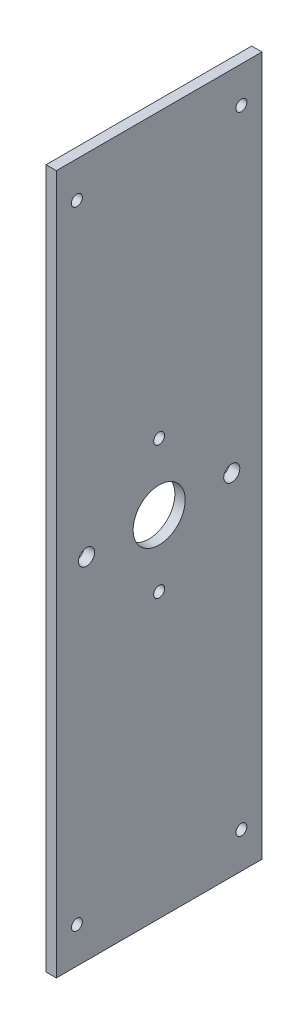
ISO-10303-21;
HEADER;
FILE_DESCRIPTION(('STEP AP214'),'2;1');
FILE_NAME('part.step','',(''),(''),'','','');
FILE_SCHEMA(('AUTOMOTIVE_DESIGN { 1 0 10303 214 1 1 1 1 }'));
ENDSEC;
DATA;
#1=APPLICATION_CONTEXT('core data for automotive mechanical design processes');
#2=APPLICATION_PROTOCOL_DEFINITION('international standard','automotive_design',2000,#1);
#3=PRODUCT_CONTEXT('',#1,'mechanical');
#4=PRODUCT('Part','Part','',(#3));
#5=PRODUCT_RELATED_PRODUCT_CATEGORY('part','',(#4));
#6=PRODUCT_DEFINITION_FORMATION('','',#4);
#7=PRODUCT_DEFINITION_CONTEXT('part definition',#1,'design');
#8=PRODUCT_DEFINITION('design','',#6,#7);
#9=PRODUCT_DEFINITION_SHAPE('','',#8);
#10=(LENGTH_UNIT() NAMED_UNIT(*) SI_UNIT(.MILLI.,.METRE.));
#11=(NAMED_UNIT(*) PLANE_ANGLE_UNIT() SI_UNIT($,.RADIAN.));
#12=(NAMED_UNIT(*) SI_UNIT($,.STERADIAN.) SOLID_ANGLE_UNIT());
#13=UNCERTAINTY_MEASURE_WITH_UNIT(LENGTH_MEASURE(1.E-05),#10,'distance_accuracy_value','');
#14=(GEOMETRIC_REPRESENTATION_CONTEXT(3) GLOBAL_UNCERTAINTY_ASSIGNED_CONTEXT((#13)) GLOBAL_UNIT_ASSIGNED_CONTEXT((#10,
#11,#12)) REPRESENTATION_CONTEXT('',''));
#15=CARTESIAN_POINT('',(0.,0.,0.));
#16=DIRECTION('',(0.,0.,1.));
#17=DIRECTION('',(1.,0.,0.));
#18=AXIS2_PLACEMENT_3D('',#15,#16,#17);
#19=CARTESIAN_POINT('',(-165.1,215.9,2082.8));
#20=DIRECTION('',(-1.,0.,0.));
#21=DIRECTION('',(0.,0.,1.));
#22=AXIS2_PLACEMENT_3D('',#19,#20,#21);
#23=PLANE('',#22);
#24=CARTESIAN_POINT('',(-165.1,0.,1666.4813));
#25=DIRECTION('',(-1.,0.,0.));
#26=DIRECTION('',(0.,0.,1.));
#27=AXIS2_PLACEMENT_3D('',#24,#25,#26);
#28=CIRCLE('',#27,4.96570000000007);
#29=CARTESIAN_POINT('',(-165.1,0.,1671.447));
#30=VERTEX_POINT('',#29);
#31=EDGE_CURVE('E17',#30,#30,#28,.F.);
#32=ORIENTED_EDGE('',*,*,#31,.T.);
#33=EDGE_LOOP('',(#32));
#34=FACE_BOUND('',#33,.T.);
#35=CARTESIAN_POINT('',(-165.1,0.,1756.1687));
#36=DIRECTION('',(-1.,0.,0.));
#37=DIRECTION('',(0.,0.,1.));
#38=AXIS2_PLACEMENT_3D('',#35,#36,#37);
#39=CIRCLE('',#38,4.96570000000007);
#40=CARTESIAN_POINT('',(-165.1,0.,1761.1344));
#41=VERTEX_POINT('',#40);
#42=EDGE_CURVE('E151',#41,#41,#39,.F.);
#43=ORIENTED_EDGE('',*,*,#42,.T.);
#44=EDGE_LOOP('',(#43));
#45=FACE_BOUND('',#44,.T.);
#46=CARTESIAN_POINT('',(-165.1,193.675,1660.525));
#47=DIRECTION('',(-1.,0.,0.));
#48=DIRECTION('',(0.,0.,1.));
#49=AXIS2_PLACEMENT_3D('',#46,#47,#48);
#50=CIRCLE('',#49,3.3782);
#51=CARTESIAN_POINT('',(-165.1,193.675,1663.9032));
#52=VERTEX_POINT('',#51);
#53=EDGE_CURVE('E147',#52,#52,#50,.F.);
#54=ORIENTED_EDGE('',*,*,#53,.T.);
#55=EDGE_LOOP('',(#54));
#56=FACE_BOUND('',#55,.T.);
#57=CARTESIAN_POINT('',(-165.1,193.675,1762.125));
#58=DIRECTION('',(-1.,0.,0.));
#59=DIRECTION('',(0.,0.,1.));
#60=AXIS2_PLACEMENT_3D('',#57,#58,#59);
#61=CIRCLE('',#60,3.3782);
#62=CARTESIAN_POINT('',(-165.1,193.675,1765.5032));
#63=VERTEX_POINT('',#62);
#64=EDGE_CURVE('E142',#63,#63,#61,.F.);
#65=ORIENTED_EDGE('',*,*,#64,.T.);
#66=EDGE_LOOP('',(#65));
#67=FACE_BOUND('',#66,.T.);
#68=CARTESIAN_POINT('',(-165.1,-193.675,1660.525));
#69=DIRECTION('',(-1.,0.,0.));
#70=DIRECTION('',(0.,0.,1.));
#71=AXIS2_PLACEMENT_3D('',#68,#69,#70);
#72=CIRCLE('',#71,3.3782);
#73=CARTESIAN_POINT('',(-165.1,-193.675,1663.9032));
#74=VERTEX_POINT('',#73);
#75=EDGE_CURVE('E137',#74,#74,#72,.F.);
#76=ORIENTED_EDGE('',*,*,#75,.T.);
#77=EDGE_LOOP('',(#76));
#78=FACE_BOUND('',#77,.T.);
#79=CARTESIAN_POINT('',(-165.1,-193.675,1762.125));
#80=DIRECTION('',(-1.,0.,0.));
#81=DIRECTION('',(0.,0.,1.));
#82=AXIS2_PLACEMENT_3D('',#79,#80,#81);
#83=CIRCLE('',#82,3.3782);
#84=CARTESIAN_POINT('',(-165.1,-193.675,1765.5032));
#85=VERTEX_POINT('',#84);
#86=EDGE_CURVE('E132',#85,#85,#83,.F.);
#87=ORIENTED_EDGE('',*,*,#86,.T.);
#88=EDGE_LOOP('',(#87));
#89=FACE_BOUND('',#88,.T.);
#90=CARTESIAN_POINT('',(-165.1,41.021,1711.325));
#91=DIRECTION('',(-1.,0.,0.));
#92=DIRECTION('',(0.,0.,1.));
#93=AXIS2_PLACEMENT_3D('',#90,#91,#92);
#94=CIRCLE('',#93,3.36549999999991);
#95=CARTESIAN_POINT('',(-165.1,41.021,1714.6905));
#96=VERTEX_POINT('',#95);
#97=EDGE_CURVE('E127',#96,#96,#94,.F.);
#98=ORIENTED_EDGE('',*,*,#97,.T.);
#99=EDGE_LOOP('',(#98));
#100=FACE_BOUND('',#99,.T.);
#101=CARTESIAN_POINT('',(-165.1,-41.021,1711.325));
#102=DIRECTION('',(-1.,0.,0.));
#103=DIRECTION('',(0.,0.,1.));
#104=AXIS2_PLACEMENT_3D('',#101,#102,#103);
#105=CIRCLE('',#104,3.36549999999991);
#106=CARTESIAN_POINT('',(-165.1,-41.021,1714.6905));
#107=VERTEX_POINT('',#106);
#108=EDGE_CURVE('E122',#107,#107,#105,.F.);
#109=ORIENTED_EDGE('',*,*,#108,.T.);
#110=EDGE_LOOP('',(#109));
#111=FACE_BOUND('',#110,.T.);
#112=CARTESIAN_POINT('',(-165.1,0.,1711.325));
#113=DIRECTION('',(-1.,0.,0.));
#114=DIRECTION('',(0.,0.,1.));
#115=AXIS2_PLACEMENT_3D('',#112,#113,#114);
#116=CIRCLE('',#115,16.0655);
#117=CARTESIAN_POINT('',(-165.1,0.,1727.3905));
#118=VERTEX_POINT('',#117);
#119=EDGE_CURVE('E108',#118,#118,#116,.F.);
#120=ORIENTED_EDGE('',*,*,#119,.T.);
#121=EDGE_LOOP('',(#120));
#122=FACE_BOUND('',#121,.T.);
#123=DIRECTION('',(0.,0.,-1.));
#124=VECTOR('',#123,1.);
#125=CARTESIAN_POINT('',(-165.1,-215.9,2082.8));
#126=LINE('',#125,#124);
#127=CARTESIAN_POINT('',(-165.1,-215.9,1774.825));
#128=VERTEX_POINT('',#127);
#129=CARTESIAN_POINT('',(-165.1,-215.9,1647.825));
#130=VERTEX_POINT('',#129);
#131=EDGE_CURVE('E103',#128,#130,#126,.T.);
#132=ORIENTED_EDGE('',*,*,#131,.F.);
#133=DIRECTION('',(0.,-1.,0.));
#134=VECTOR('',#133,1.);
#135=CARTESIAN_POINT('',(-165.1,215.9,1774.825));
#136=LINE('',#135,#134);
#137=CARTESIAN_POINT('',(-165.1,215.9,1774.825));
#138=VERTEX_POINT('',#137);
#139=EDGE_CURVE('E38',#138,#128,#136,.T.);
#140=ORIENTED_EDGE('',*,*,#139,.F.);
#141=DIRECTION('',(0.,0.,-1.));
#142=VECTOR('',#141,1.);
#143=CARTESIAN_POINT('',(-165.1,215.9,2082.8));
#144=LINE('',#143,#142);
#145=CARTESIAN_POINT('',(-165.1,215.9,1647.825));
#146=VERTEX_POINT('',#145);
#147=EDGE_CURVE('E90',#138,#146,#144,.T.);
#148=ORIENTED_EDGE('',*,*,#147,.T.);
#149=DIRECTION('',(0.,-1.,0.));
#150=VECTOR('',#149,1.);
#151=CARTESIAN_POINT('',(-165.1,215.9,1647.825));
#152=LINE('',#151,#150);
#153=EDGE_CURVE('E9',#146,#130,#152,.T.);
#154=ORIENTED_EDGE('',*,*,#153,.T.);
#155=EDGE_LOOP('',(#132,#140,#148,#154));
#156=FACE_BOUND('',#155,.T.);
#157=ADVANCED_FACE('F14',(#34,#45,#56,#67,#78,#89,#100,#111,#122,#156),#23,.T.);
#158=CARTESIAN_POINT('',(-161.657917049904,215.9,1647.825));
#159=DIRECTION('',(0.,0.,-1.));
#160=DIRECTION('',(-1.,0.,0.));
#161=AXIS2_PLACEMENT_3D('',#158,#159,#160);
#162=PLANE('',#161);
#163=DIRECTION('',(1.,0.,0.));
#164=VECTOR('',#163,1.);
#165=CARTESIAN_POINT('',(-161.657917049904,-215.9,1647.825));
#166=LINE('',#165,#164);
#167=CARTESIAN_POINT('',(-158.75,-215.9,1647.825));
#168=VERTEX_POINT('',#167);
#169=EDGE_CURVE('E107',#130,#168,#166,.T.);
#170=ORIENTED_EDGE('',*,*,#169,.F.);
#171=ORIENTED_EDGE('',*,*,#153,.F.);
#172=DIRECTION('',(1.,0.,0.));
#173=VECTOR('',#172,1.);
#174=CARTESIAN_POINT('',(-161.657917049904,215.9,1647.825));
#175=LINE('',#174,#173);
#176=CARTESIAN_POINT('',(-158.75,215.9,1647.825));
#177=VERTEX_POINT('',#176);
#178=EDGE_CURVE('E85',#146,#177,#175,.T.);
#179=ORIENTED_EDGE('',*,*,#178,.T.);
#180=DIRECTION('',(0.,-1.,0.));
#181=VECTOR('',#180,1.);
#182=CARTESIAN_POINT('',(-158.75,215.9,1647.825));
#183=LINE('',#182,#181);
#184=EDGE_CURVE('E24',#177,#168,#183,.T.);
#185=ORIENTED_EDGE('',*,*,#184,.T.);
#186=EDGE_LOOP('',(#170,#171,#179,#185));
#187=FACE_BOUND('',#186,.T.);
#188=ADVANCED_FACE('F86',(#187),#162,.T.);
#189=CARTESIAN_POINT('',(-158.75,215.9,1176.90814380646));
#190=DIRECTION('',(-1.,0.,0.));
#191=DIRECTION('',(0.,0.,1.));
#192=AXIS2_PLACEMENT_3D('',#189,#190,#191);
#193=PLANE('',#192);
#194=CARTESIAN_POINT('',(-158.75,0.,1666.4813));
#195=DIRECTION('',(1.,0.,0.));
#196=DIRECTION('',(0.,0.,-1.));
#197=AXIS2_PLACEMENT_3D('',#194,#195,#196);
#198=CIRCLE('',#197,4.96570000000007);
#199=CARTESIAN_POINT('',(-158.75,0.,1661.5156));
#200=VERTEX_POINT('',#199);
#201=EDGE_CURVE('E171',#200,#200,#198,.T.);
#202=ORIENTED_EDGE('',*,*,#201,.F.);
#203=EDGE_LOOP('',(#202));
#204=FACE_BOUND('',#203,.T.);
#205=CARTESIAN_POINT('',(-158.75,0.,1756.1687));
#206=DIRECTION('',(1.,0.,0.));
#207=DIRECTION('',(0.,0.,-1.));
#208=AXIS2_PLACEMENT_3D('',#205,#206,#207);
#209=CIRCLE('',#208,4.96570000000007);
#210=CARTESIAN_POINT('',(-158.75,0.,1751.203));
#211=VERTEX_POINT('',#210);
#212=EDGE_CURVE('E154',#211,#211,#209,.T.);
#213=ORIENTED_EDGE('',*,*,#212,.F.);
#214=EDGE_LOOP('',(#213));
#215=FACE_BOUND('',#214,.T.);
#216=CARTESIAN_POINT('',(-158.75,193.675,1660.525));
#217=DIRECTION('',(1.,0.,0.));
#218=DIRECTION('',(0.,0.,-1.));
#219=AXIS2_PLACEMENT_3D('',#216,#217,#218);
#220=CIRCLE('',#219,3.3782);
#221=CARTESIAN_POINT('',(-158.75,193.675,1657.1468));
#222=VERTEX_POINT('',#221);
#223=EDGE_CURVE('E150',#222,#222,#220,.T.);
#224=ORIENTED_EDGE('',*,*,#223,.F.);
#225=EDGE_LOOP('',(#224));
#226=FACE_BOUND('',#225,.T.);
#227=CARTESIAN_POINT('',(-158.75,193.675,1762.125));
#228=DIRECTION('',(1.,0.,0.));
#229=DIRECTION('',(0.,0.,-1.));
#230=AXIS2_PLACEMENT_3D('',#227,#228,#229);
#231=CIRCLE('',#230,3.3782);
#232=CARTESIAN_POINT('',(-158.75,193.675,1758.7468));
#233=VERTEX_POINT('',#232);
#234=EDGE_CURVE('E146',#233,#233,#231,.T.);
#235=ORIENTED_EDGE('',*,*,#234,.F.);
#236=EDGE_LOOP('',(#235));
#237=FACE_BOUND('',#236,.T.);
#238=CARTESIAN_POINT('',(-158.75,-193.675,1660.525));
#239=DIRECTION('',(1.,0.,0.));
#240=DIRECTION('',(0.,0.,-1.));
#241=AXIS2_PLACEMENT_3D('',#238,#239,#240);
#242=CIRCLE('',#241,3.3782);
#243=CARTESIAN_POINT('',(-158.75,-193.675,1657.1468));
#244=VERTEX_POINT('',#243);
#245=EDGE_CURVE('E141',#244,#244,#242,.T.);
#246=ORIENTED_EDGE('',*,*,#245,.F.);
#247=EDGE_LOOP('',(#246));
#248=FACE_BOUND('',#247,.T.);
#249=CARTESIAN_POINT('',(-158.75,-193.675,1762.125));
#250=DIRECTION('',(1.,0.,0.));
#251=DIRECTION('',(0.,0.,-1.));
#252=AXIS2_PLACEMENT_3D('',#249,#250,#251);
#253=CIRCLE('',#252,3.3782);
#254=CARTESIAN_POINT('',(-158.75,-193.675,1758.7468));
#255=VERTEX_POINT('',#254);
#256=EDGE_CURVE('E136',#255,#255,#253,.T.);
#257=ORIENTED_EDGE('',*,*,#256,.F.);
#258=EDGE_LOOP('',(#257));
#259=FACE_BOUND('',#258,.T.);
#260=CARTESIAN_POINT('',(-158.75,41.021,1711.325));
#261=DIRECTION('',(1.,0.,0.));
#262=DIRECTION('',(0.,0.,-1.));
#263=AXIS2_PLACEMENT_3D('',#260,#261,#262);
#264=CIRCLE('',#263,3.36549999999991);
#265=CARTESIAN_POINT('',(-158.75,41.021,1707.9595));
#266=VERTEX_POINT('',#265);
#267=EDGE_CURVE('E131',#266,#266,#264,.T.);
#268=ORIENTED_EDGE('',*,*,#267,.F.);
#269=EDGE_LOOP('',(#268));
#270=FACE_BOUND('',#269,.T.);
#271=CARTESIAN_POINT('',(-158.75,-41.021,1711.325));
#272=DIRECTION('',(1.,0.,0.));
#273=DIRECTION('',(0.,0.,-1.));
#274=AXIS2_PLACEMENT_3D('',#271,#272,#273);
#275=CIRCLE('',#274,3.36549999999991);
#276=CARTESIAN_POINT('',(-158.75,-41.021,1707.9595));
#277=VERTEX_POINT('',#276);
#278=EDGE_CURVE('E126',#277,#277,#275,.T.);
#279=ORIENTED_EDGE('',*,*,#278,.F.);
#280=EDGE_LOOP('',(#279));
#281=FACE_BOUND('',#280,.T.);
#282=CARTESIAN_POINT('',(-158.75,0.,1711.325));
#283=DIRECTION('',(1.,0.,0.));
#284=DIRECTION('',(0.,0.,-1.));
#285=AXIS2_PLACEMENT_3D('',#282,#283,#284);
#286=CIRCLE('',#285,16.0655);
#287=CARTESIAN_POINT('',(-158.75,0.,1695.2595));
#288=VERTEX_POINT('',#287);
#289=EDGE_CURVE('E121',#288,#288,#286,.T.);
#290=ORIENTED_EDGE('',*,*,#289,.F.);
#291=EDGE_LOOP('',(#290));
#292=FACE_BOUND('',#291,.T.);
#293=DIRECTION('',(0.,0.,-1.));
#294=VECTOR('',#293,1.);
#295=CARTESIAN_POINT('',(-158.75,-215.9,1176.90814380646));
#296=LINE('',#295,#294);
#297=CARTESIAN_POINT('',(-158.75,-215.9,1774.825));
#298=VERTEX_POINT('',#297);
#299=EDGE_CURVE('E81',#298,#168,#296,.T.);
#300=ORIENTED_EDGE('',*,*,#299,.T.);
#301=ORIENTED_EDGE('',*,*,#184,.F.);
#302=DIRECTION('',(0.,0.,-1.));
#303=VECTOR('',#302,1.);
#304=CARTESIAN_POINT('',(-158.75,215.9,1176.90814380646));
#305=LINE('',#304,#303);
#306=CARTESIAN_POINT('',(-158.75,215.9,1774.825));
#307=VERTEX_POINT('',#306);
#308=EDGE_CURVE('E78',#307,#177,#305,.T.);
#309=ORIENTED_EDGE('',*,*,#308,.F.);
#310=DIRECTION('',(0.,-1.,0.));
#311=VECTOR('',#310,1.);
#312=CARTESIAN_POINT('',(-158.75,215.9,1774.825));
#313=LINE('',#312,#311);
#314=EDGE_CURVE('E58',#307,#298,#313,.T.);
#315=ORIENTED_EDGE('',*,*,#314,.T.);
#316=EDGE_LOOP('',(#300,#301,#309,#315));
#317=FACE_BOUND('',#316,.T.);
#318=ADVANCED_FACE('F76',(#204,#215,#226,#237,#248,#259,#270,#281,#292,#317),#193,.F.);
#319=CARTESIAN_POINT('',(-161.657917049904,215.9,1774.825));
#320=DIRECTION('',(0.,0.,-1.));
#321=DIRECTION('',(-1.,0.,0.));
#322=AXIS2_PLACEMENT_3D('',#319,#320,#321);
#323=PLANE('',#322);
#324=DIRECTION('',(1.,0.,0.));
#325=VECTOR('',#324,1.);
#326=CARTESIAN_POINT('',(-161.657917049904,-215.9,1774.825));
#327=LINE('',#326,#325);
#328=EDGE_CURVE('E112',#128,#298,#327,.T.);
#329=ORIENTED_EDGE('',*,*,#328,.T.);
#330=ORIENTED_EDGE('',*,*,#314,.F.);
#331=DIRECTION('',(1.,0.,0.));
#332=VECTOR('',#331,1.);
#333=CARTESIAN_POINT('',(-161.657917049904,215.9,1774.825));
#334=LINE('',#333,#332);
#335=EDGE_CURVE('E93',#138,#307,#334,.T.);
#336=ORIENTED_EDGE('',*,*,#335,.F.);
#337=ORIENTED_EDGE('',*,*,#139,.T.);
#338=EDGE_LOOP('',(#329,#330,#336,#337));
#339=FACE_BOUND('',#338,.T.);
#340=ADVANCED_FACE('F195',(#339),#323,.F.);
#341=CARTESIAN_POINT('',(-187.325,215.9,1041.4));
#342=DIRECTION('',(0.,-1.,0.));
#343=DIRECTION('',(1.,0.,0.));
#344=AXIS2_PLACEMENT_3D('',#341,#342,#343);
#345=PLANE('',#344);
#346=ORIENTED_EDGE('',*,*,#147,.F.);
#347=ORIENTED_EDGE('',*,*,#335,.T.);
#348=ORIENTED_EDGE('',*,*,#308,.T.);
#349=ORIENTED_EDGE('',*,*,#178,.F.);
#350=EDGE_LOOP('',(#346,#347,#348,#349));
#351=FACE_BOUND('',#350,.T.);
#352=ADVANCED_FACE('F92',(#351),#345,.F.);
#353=CARTESIAN_POINT('',(-187.325,-215.9,1041.4));
#354=DIRECTION('',(0.,-1.,0.));
#355=DIRECTION('',(1.,0.,0.));
#356=AXIS2_PLACEMENT_3D('',#353,#354,#355);
#357=PLANE('',#356);
#358=ORIENTED_EDGE('',*,*,#131,.T.);
#359=ORIENTED_EDGE('',*,*,#169,.T.);
#360=ORIENTED_EDGE('',*,*,#299,.F.);
#361=ORIENTED_EDGE('',*,*,#328,.F.);
#362=EDGE_LOOP('',(#358,#359,#360,#361));
#363=FACE_BOUND('',#362,.T.);
#364=ADVANCED_FACE('F194',(#363),#357,.T.);
#365=CARTESIAN_POINT('',(-613.710501538055,0.,1711.325));
#366=DIRECTION('',(1.,0.,0.));
#367=DIRECTION('',(0.,0.,-1.));
#368=AXIS2_PLACEMENT_3D('',#365,#366,#367);
#369=CYLINDRICAL_SURFACE('',#368,16.0655);
#370=ORIENTED_EDGE('',*,*,#119,.F.);
#371=EDGE_LOOP('',(#370));
#372=FACE_BOUND('',#371,.T.);
#373=ORIENTED_EDGE('',*,*,#289,.T.);
#374=EDGE_LOOP('',(#373));
#375=FACE_BOUND('',#374,.T.);
#376=ADVANCED_FACE('F228',(#372,#375),#369,.F.);
#377=CARTESIAN_POINT('',(-609.89503660723,-41.021,1711.325));
#378=DIRECTION('',(1.,0.,0.));
#379=DIRECTION('',(0.,0.,-1.));
#380=AXIS2_PLACEMENT_3D('',#377,#378,#379);
#381=CYLINDRICAL_SURFACE('',#380,3.36549999999991);
#382=ORIENTED_EDGE('',*,*,#108,.F.);
#383=EDGE_LOOP('',(#382));
#384=FACE_BOUND('',#383,.T.);
#385=ORIENTED_EDGE('',*,*,#278,.T.);
#386=EDGE_LOOP('',(#385));
#387=FACE_BOUND('',#386,.T.);
#388=ADVANCED_FACE('F231',(#384,#387),#381,.F.);
#389=CARTESIAN_POINT('',(-609.89503660723,41.021,1711.325));
#390=DIRECTION('',(1.,0.,0.));
#391=DIRECTION('',(0.,0.,-1.));
#392=AXIS2_PLACEMENT_3D('',#389,#390,#391);
#393=CYLINDRICAL_SURFACE('',#392,3.36549999999991);
#394=ORIENTED_EDGE('',*,*,#97,.F.);
#395=EDGE_LOOP('',(#394));
#396=FACE_BOUND('',#395,.T.);
#397=ORIENTED_EDGE('',*,*,#267,.T.);
#398=EDGE_LOOP('',(#397));
#399=FACE_BOUND('',#398,.T.);
#400=ADVANCED_FACE('F239',(#396,#399),#393,.F.);
#401=CARTESIAN_POINT('',(-2287.62139438171,-193.675,1762.125));
#402=DIRECTION('',(1.,0.,0.));
#403=DIRECTION('',(0.,0.,-1.));
#404=AXIS2_PLACEMENT_3D('',#401,#402,#403);
#405=CYLINDRICAL_SURFACE('',#404,3.3782);
#406=ORIENTED_EDGE('',*,*,#86,.F.);
#407=EDGE_LOOP('',(#406));
#408=FACE_BOUND('',#407,.T.);
#409=ORIENTED_EDGE('',*,*,#256,.T.);
#410=EDGE_LOOP('',(#409));
#411=FACE_BOUND('',#410,.T.);
#412=ADVANCED_FACE('F245',(#408,#411),#405,.F.);
#413=CARTESIAN_POINT('',(-2287.62139438171,-193.675,1660.525));
#414=DIRECTION('',(1.,0.,0.));
#415=DIRECTION('',(0.,0.,-1.));
#416=AXIS2_PLACEMENT_3D('',#413,#414,#415);
#417=CYLINDRICAL_SURFACE('',#416,3.3782);
#418=ORIENTED_EDGE('',*,*,#75,.F.);
#419=EDGE_LOOP('',(#418));
#420=FACE_BOUND('',#419,.T.);
#421=ORIENTED_EDGE('',*,*,#245,.T.);
#422=EDGE_LOOP('',(#421));
#423=FACE_BOUND('',#422,.T.);
#424=ADVANCED_FACE('F249',(#420,#423),#417,.F.);
#425=CARTESIAN_POINT('',(-2287.62139438171,193.675,1762.125));
#426=DIRECTION('',(1.,0.,0.));
#427=DIRECTION('',(0.,0.,-1.));
#428=AXIS2_PLACEMENT_3D('',#425,#426,#427);
#429=CYLINDRICAL_SURFACE('',#428,3.3782);
#430=ORIENTED_EDGE('',*,*,#64,.F.);
#431=EDGE_LOOP('',(#430));
#432=FACE_BOUND('',#431,.T.);
#433=ORIENTED_EDGE('',*,*,#234,.T.);
#434=EDGE_LOOP('',(#433));
#435=FACE_BOUND('',#434,.T.);
#436=ADVANCED_FACE('F253',(#432,#435),#429,.F.);
#437=CARTESIAN_POINT('',(-2287.62139438171,193.675,1660.525));
#438=DIRECTION('',(1.,0.,0.));
#439=DIRECTION('',(0.,0.,-1.));
#440=AXIS2_PLACEMENT_3D('',#437,#438,#439);
#441=CYLINDRICAL_SURFACE('',#440,3.3782);
#442=ORIENTED_EDGE('',*,*,#53,.F.);
#443=EDGE_LOOP('',(#442));
#444=FACE_BOUND('',#443,.T.);
#445=ORIENTED_EDGE('',*,*,#223,.T.);
#446=EDGE_LOOP('',(#445));
#447=FACE_BOUND('',#446,.T.);
#448=ADVANCED_FACE('F257',(#444,#447),#441,.F.);
#449=CARTESIAN_POINT('',(-610.375785188514,0.,1756.1687));
#450=DIRECTION('',(1.,0.,0.));
#451=DIRECTION('',(0.,0.,-1.));
#452=AXIS2_PLACEMENT_3D('',#449,#450,#451);
#453=CYLINDRICAL_SURFACE('',#452,4.96570000000007);
#454=ORIENTED_EDGE('',*,*,#42,.F.);
#455=EDGE_LOOP('',(#454));
#456=FACE_BOUND('',#455,.T.);
#457=ORIENTED_EDGE('',*,*,#212,.T.);
#458=EDGE_LOOP('',(#457));
#459=FACE_BOUND('',#458,.T.);
#460=ADVANCED_FACE('F261',(#456,#459),#453,.F.);
#461=CARTESIAN_POINT('',(-610.375785188514,0.,1666.4813));
#462=DIRECTION('',(1.,0.,0.));
#463=DIRECTION('',(0.,0.,-1.));
#464=AXIS2_PLACEMENT_3D('',#461,#462,#463);
#465=CYLINDRICAL_SURFACE('',#464,4.96570000000007);
#466=ORIENTED_EDGE('',*,*,#31,.F.);
#467=EDGE_LOOP('',(#466));
#468=FACE_BOUND('',#467,.T.);
#469=ORIENTED_EDGE('',*,*,#201,.T.);
#470=EDGE_LOOP('',(#469));
#471=FACE_BOUND('',#470,.T.);
#472=ADVANCED_FACE('F265',(#468,#471),#465,.F.);
#473=CLOSED_SHELL('',(#157,#188,#318,#340,#352,#364,#376,#388,#400,#412,#424,#436,#448,#460,#472));
#474=MANIFOLD_SOLID_BREP('B1',#473);
#475=ADVANCED_BREP_SHAPE_REPRESENTATION('',(#18,#474),#14);
#476=SHAPE_DEFINITION_REPRESENTATION(#9,#475);
ENDSEC;
END-ISO-10303-21;
